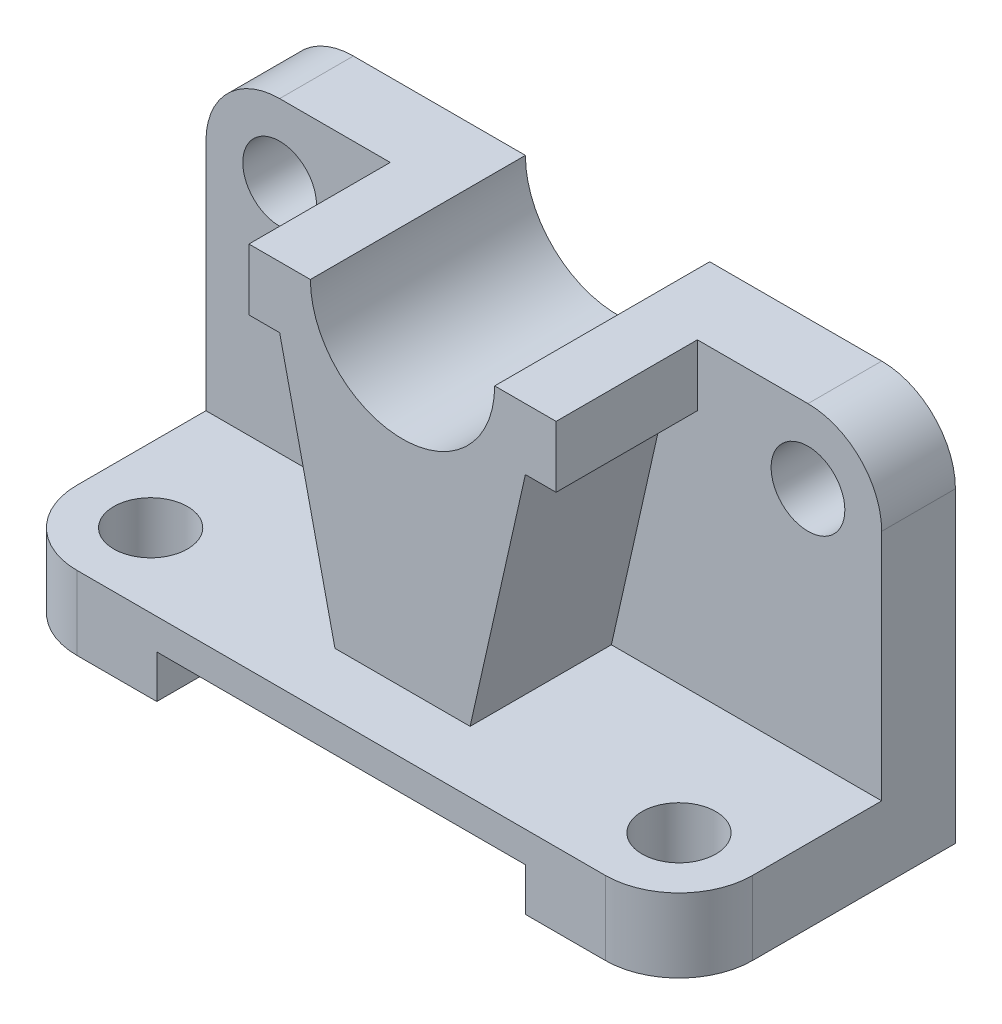
ISO-10303-21;
HEADER;
FILE_DESCRIPTION(('STEP AP214'),'2;1');
FILE_NAME('part.step','',(''),(''),'','','');
FILE_SCHEMA(('AUTOMOTIVE_DESIGN { 1 0 10303 214 1 1 1 1 }'));
ENDSEC;
DATA;
#1=APPLICATION_CONTEXT('core data for automotive mechanical design processes');
#2=APPLICATION_PROTOCOL_DEFINITION('international standard','automotive_design',2000,#1);
#3=PRODUCT_CONTEXT('',#1,'mechanical');
#4=PRODUCT('Part','Part','',(#3));
#5=PRODUCT_RELATED_PRODUCT_CATEGORY('part','',(#4));
#6=PRODUCT_DEFINITION_FORMATION('','',#4);
#7=PRODUCT_DEFINITION_CONTEXT('part definition',#1,'design');
#8=PRODUCT_DEFINITION('design','',#6,#7);
#9=PRODUCT_DEFINITION_SHAPE('','',#8);
#10=(LENGTH_UNIT() NAMED_UNIT(*) SI_UNIT(.MILLI.,.METRE.));
#11=(NAMED_UNIT(*) PLANE_ANGLE_UNIT() SI_UNIT($,.RADIAN.));
#12=(NAMED_UNIT(*) SI_UNIT($,.STERADIAN.) SOLID_ANGLE_UNIT());
#13=UNCERTAINTY_MEASURE_WITH_UNIT(LENGTH_MEASURE(1.E-05),#10,'distance_accuracy_value','');
#14=(GEOMETRIC_REPRESENTATION_CONTEXT(3) GLOBAL_UNCERTAINTY_ASSIGNED_CONTEXT((#13)) GLOBAL_UNIT_ASSIGNED_CONTEXT((#10,
#11,#12)) REPRESENTATION_CONTEXT('',''));
#15=CARTESIAN_POINT('',(0.,0.,0.));
#16=DIRECTION('',(0.,0.,1.));
#17=DIRECTION('',(1.,0.,0.));
#18=AXIS2_PLACEMENT_3D('',#15,#16,#17);
#19=CARTESIAN_POINT('',(110.,39.1654570634222,-10.4242661385534));
#20=DIRECTION('',(0.,-1.,0.));
#21=DIRECTION('',(0.,0.,-1.));
#22=AXIS2_PLACEMENT_3D('',#19,#20,#21);
#23=PLANE('',#22);
#24=DIRECTION('',(-1.,0.,0.));
#25=VECTOR('',#24,1.);
#26=CARTESIAN_POINT('',(110.,39.1654570634222,-22.4242661385534));
#27=LINE('',#26,#25);
#28=CARTESIAN_POINT('',(98.,39.1654570634222,-22.4242661385534));
#29=VERTEX_POINT('',#28);
#30=CARTESIAN_POINT('',(70.,39.1654570634222,-22.4242661385534));
#31=VERTEX_POINT('',#30);
#32=EDGE_CURVE('E221',#29,#31,#27,.T.);
#33=ORIENTED_EDGE('',*,*,#32,.T.);
#34=DIRECTION('',(0.,0.,1.));
#35=VECTOR('',#34,1.);
#36=CARTESIAN_POINT('',(70.,39.1654570634222,-22.4242661385534));
#37=LINE('',#36,#35);
#38=CARTESIAN_POINT('',(70.,39.1654570634222,12.5757338614466));
#39=VERTEX_POINT('',#38);
#40=EDGE_CURVE('E204',#31,#39,#37,.T.);
#41=ORIENTED_EDGE('',*,*,#40,.T.);
#42=DIRECTION('',(-1.,0.,0.));
#43=VECTOR('',#42,1.);
#44=CARTESIAN_POINT('',(70.,39.1654570634222,12.5757338614466));
#45=LINE('',#44,#43);
#46=CARTESIAN_POINT('',(80.,39.1654570634222,12.5757338614466));
#47=VERTEX_POINT('',#46);
#48=EDGE_CURVE('E215',#47,#39,#45,.T.);
#49=ORIENTED_EDGE('',*,*,#48,.F.);
#50=DIRECTION('',(0.,0.,1.));
#51=VECTOR('',#50,1.);
#52=CARTESIAN_POINT('',(80.,39.1654570634222,-22.4242661385534));
#53=LINE('',#52,#51);
#54=CARTESIAN_POINT('',(80.,39.1654570634222,-10.4242661385534));
#55=VERTEX_POINT('',#54);
#56=EDGE_CURVE('E310',#55,#47,#53,.T.);
#57=ORIENTED_EDGE('',*,*,#56,.F.);
#58=DIRECTION('',(-1.,0.,0.));
#59=VECTOR('',#58,1.);
#60=CARTESIAN_POINT('',(110.,39.1654570634222,-10.4242661385534));
#61=LINE('',#60,#59);
#62=CARTESIAN_POINT('',(98.,39.1654570634222,-10.4242661385534));
#63=VERTEX_POINT('',#62);
#64=EDGE_CURVE('E231',#63,#55,#61,.T.);
#65=ORIENTED_EDGE('',*,*,#64,.F.);
#66=DIRECTION('',(0.,0.,1.));
#67=VECTOR('',#66,1.);
#68=CARTESIAN_POINT('',(98.,39.1654570634222,-10.4242661385534));
#69=LINE('',#68,#67);
#70=EDGE_CURVE('E228',#63,#29,#69,.F.);
#71=ORIENTED_EDGE('',*,*,#70,.T.);
#72=EDGE_LOOP('',(#33,#41,#49,#57,#65,#71));
#73=FACE_BOUND('',#72,.T.);
#74=ADVANCED_FACE('F39',(#73),#23,.F.);
#75=CARTESIAN_POINT('',(110.,-22.8345429365778,-22.4242661385534));
#76=DIRECTION('',(0.,1.,0.));
#77=DIRECTION('',(0.,0.,1.));
#78=AXIS2_PLACEMENT_3D('',#75,#76,#77);
#79=PLANE('',#78);
#80=CARTESIAN_POINT('',(12.,-22.8345429365778,10.5757338614466));
#81=DIRECTION('',(0.,1.,0.));
#82=DIRECTION('',(0.,0.,1.));
#83=AXIS2_PLACEMENT_3D('',#80,#81,#82);
#84=CIRCLE('',#83,6.);
#85=CARTESIAN_POINT('',(12.,-22.8345429365778,16.5757338614466));
#86=VERTEX_POINT('',#85);
#87=EDGE_CURVE('E453',#86,#86,#84,.T.);
#88=ORIENTED_EDGE('',*,*,#87,.T.);
#89=EDGE_LOOP('',(#88));
#90=FACE_BOUND('',#89,.T.);
#91=DIRECTION('',(-1.,0.,0.));
#92=VECTOR('',#91,1.);
#93=CARTESIAN_POINT('',(110.,-22.8345429365778,-22.4242661385534));
#94=LINE('',#93,#92);
#95=CARTESIAN_POINT('',(25.,-22.8345429365778,-22.4242661385534));
#96=VERTEX_POINT('',#95);
#97=CARTESIAN_POINT('',(0.,-22.8345429365778,-22.4242661385534));
#98=VERTEX_POINT('',#97);
#99=EDGE_CURVE('E431',#96,#98,#94,.T.);
#100=ORIENTED_EDGE('',*,*,#99,.F.);
#101=DIRECTION('',(0.,0.,1.));
#102=VECTOR('',#101,1.);
#103=CARTESIAN_POINT('',(25.,-22.8345429365778,-22.4242661385534));
#104=LINE('',#103,#102);
#105=CARTESIAN_POINT('',(25.,-22.8345429365778,22.5757338614466));
#106=VERTEX_POINT('',#105);
#107=EDGE_CURVE('E273',#96,#106,#104,.T.);
#108=ORIENTED_EDGE('',*,*,#107,.T.);
#109=DIRECTION('',(-1.,0.,0.));
#110=VECTOR('',#109,1.);
#111=CARTESIAN_POINT('',(110.,-22.8345429365778,22.5757338614466));
#112=LINE('',#111,#110);
#113=CARTESIAN_POINT('',(12.,-22.8345429365778,22.5757338614466));
#114=VERTEX_POINT('',#113);
#115=EDGE_CURVE('E427',#106,#114,#112,.T.);
#116=ORIENTED_EDGE('',*,*,#115,.T.);
#117=CARTESIAN_POINT('',(12.,-22.8345429365778,10.5757338614466));
#118=DIRECTION('',(0.,1.,0.));
#119=DIRECTION('',(0.,0.,1.));
#120=AXIS2_PLACEMENT_3D('',#117,#118,#119);
#121=CIRCLE('',#120,12.);
#122=CARTESIAN_POINT('',(0.,-22.8345429365778,10.5757338614465));
#123=VERTEX_POINT('',#122);
#124=EDGE_CURVE('E259',#114,#123,#121,.F.);
#125=ORIENTED_EDGE('',*,*,#124,.T.);
#126=DIRECTION('',(0.,0.,-1.));
#127=VECTOR('',#126,1.);
#128=CARTESIAN_POINT('',(0.,-22.8345429365778,-22.4242661385534));
#129=LINE('',#128,#127);
#130=EDGE_CURVE('E432',#123,#98,#129,.T.);
#131=ORIENTED_EDGE('',*,*,#130,.T.);
#132=EDGE_LOOP('',(#100,#108,#116,#125,#131));
#133=FACE_BOUND('',#132,.T.);
#134=ADVANCED_FACE('F505',(#90,#133),#79,.F.);
#135=CARTESIAN_POINT('',(110.,39.1654570634222,-22.4242661385534));
#136=DIRECTION('',(0.,0.,1.));
#137=DIRECTION('',(0.,-1.,0.));
#138=AXIS2_PLACEMENT_3D('',#135,#136,#137);
#139=PLANE('',#138);
#140=CARTESIAN_POINT('',(40.,39.1654570634222,-22.4242661385534));
#141=VERTEX_POINT('',#140);
#142=CARTESIAN_POINT('',(12.,39.1654570634222,-22.4242661385534));
#143=VERTEX_POINT('',#142);
#144=EDGE_CURVE('E43',#141,#143,#27,.T.);
#145=ORIENTED_EDGE('',*,*,#144,.F.);
#146=CARTESIAN_POINT('',(55.,39.1654570634222,-22.4242661385534));
#147=DIRECTION('',(0.,0.,1.));
#148=DIRECTION('',(0.,-1.,0.));
#149=AXIS2_PLACEMENT_3D('',#146,#147,#148);
#150=CIRCLE('',#149,15.);
#151=EDGE_CURVE('E207',#141,#31,#150,.T.);
#152=ORIENTED_EDGE('',*,*,#151,.T.);
#153=ORIENTED_EDGE('',*,*,#32,.F.);
#154=CARTESIAN_POINT('',(98.,27.1654570634222,-22.4242661385534));
#155=DIRECTION('',(0.,0.,1.));
#156=DIRECTION('',(0.,-1.,0.));
#157=AXIS2_PLACEMENT_3D('',#154,#155,#156);
#158=CIRCLE('',#157,12.);
#159=CARTESIAN_POINT('',(110.,27.1654570634222,-22.4242661385534));
#160=VERTEX_POINT('',#159);
#161=EDGE_CURVE('E248',#29,#160,#158,.F.);
#162=ORIENTED_EDGE('',*,*,#161,.T.);
#163=DIRECTION('',(0.,1.,0.));
#164=VECTOR('',#163,1.);
#165=CARTESIAN_POINT('',(110.,39.1654570634222,-22.4242661385534));
#166=LINE('',#165,#164);
#167=CARTESIAN_POINT('',(110.,-22.8345429365778,-22.4242661385534));
#168=VERTEX_POINT('',#167);
#169=EDGE_CURVE('E435',#168,#160,#166,.T.);
#170=ORIENTED_EDGE('',*,*,#169,.F.);
#171=CARTESIAN_POINT('',(85.,-22.8345429365778,-22.4242661385534));
#172=VERTEX_POINT('',#171);
#173=EDGE_CURVE('E428',#168,#172,#94,.T.);
#174=ORIENTED_EDGE('',*,*,#173,.T.);
#175=DIRECTION('',(0.,1.,0.));
#176=VECTOR('',#175,1.);
#177=CARTESIAN_POINT('',(85.,39.1654570634222,-22.4242661385534));
#178=LINE('',#177,#176);
#179=CARTESIAN_POINT('',(85.,-15.8345429365778,-22.4242661385534));
#180=VERTEX_POINT('',#179);
#181=EDGE_CURVE('E65',#172,#180,#178,.T.);
#182=ORIENTED_EDGE('',*,*,#181,.T.);
#183=DIRECTION('',(-1.,0.,0.));
#184=VECTOR('',#183,1.);
#185=CARTESIAN_POINT('',(110.,-15.8345429365778,-22.4242661385534));
#186=LINE('',#185,#184);
#187=CARTESIAN_POINT('',(25.,-15.8345429365778,-22.4242661385534));
#188=VERTEX_POINT('',#187);
#189=EDGE_CURVE('E469',#180,#188,#186,.T.);
#190=ORIENTED_EDGE('',*,*,#189,.T.);
#191=DIRECTION('',(0.,-1.,0.));
#192=VECTOR('',#191,1.);
#193=CARTESIAN_POINT('',(25.,39.1654570634222,-22.4242661385534));
#194=LINE('',#193,#192);
#195=EDGE_CURVE('E479',#188,#96,#194,.T.);
#196=ORIENTED_EDGE('',*,*,#195,.T.);
#197=ORIENTED_EDGE('',*,*,#99,.T.);
#198=DIRECTION('',(0.,1.,0.));
#199=VECTOR('',#198,1.);
#200=CARTESIAN_POINT('',(0.,39.1654570634222,-22.4242661385534));
#201=LINE('',#200,#199);
#202=CARTESIAN_POINT('',(0.,27.1654570634222,-22.4242661385534));
#203=VERTEX_POINT('',#202);
#204=EDGE_CURVE('E440',#98,#203,#201,.T.);
#205=ORIENTED_EDGE('',*,*,#204,.T.);
#206=CARTESIAN_POINT('',(12.,27.1654570634222,-22.4242661385534));
#207=DIRECTION('',(0.,0.,1.));
#208=DIRECTION('',(0.,-1.,0.));
#209=AXIS2_PLACEMENT_3D('',#206,#207,#208);
#210=CIRCLE('',#209,12.);
#211=EDGE_CURVE('E250',#203,#143,#210,.F.);
#212=ORIENTED_EDGE('',*,*,#211,.T.);
#213=EDGE_LOOP('',(#145,#152,#153,#162,#170,#174,#182,#190,#196,#197,#205,#212));
#214=FACE_BOUND('',#213,.T.);
#215=CARTESIAN_POINT('',(12.,27.1654570634222,-22.4242661385534));
#216=DIRECTION('',(0.,0.,1.));
#217=DIRECTION('',(1.,0.,0.));
#218=AXIS2_PLACEMENT_3D('',#215,#216,#217);
#219=CIRCLE('',#218,6.);
#220=CARTESIAN_POINT('',(18.,27.1654570634222,-22.4242661385534));
#221=VERTEX_POINT('',#220);
#222=EDGE_CURVE('E457',#221,#221,#219,.T.);
#223=ORIENTED_EDGE('',*,*,#222,.T.);
#224=EDGE_LOOP('',(#223));
#225=FACE_BOUND('',#224,.T.);
#226=CARTESIAN_POINT('',(98.,27.1654570634222,-22.4242661385534));
#227=DIRECTION('',(0.,0.,1.));
#228=DIRECTION('',(1.,0.,0.));
#229=AXIS2_PLACEMENT_3D('',#226,#227,#228);
#230=CIRCLE('',#229,6.);
#231=CARTESIAN_POINT('',(104.,27.1654570634222,-22.4242661385534));
#232=VERTEX_POINT('',#231);
#233=EDGE_CURVE('E465',#232,#232,#230,.T.);
#234=ORIENTED_EDGE('',*,*,#233,.T.);
#235=EDGE_LOOP('',(#234));
#236=FACE_BOUND('',#235,.T.);
#237=ADVANCED_FACE('F219',(#214,#225,#236),#139,.F.);
#238=DIRECTION('',(0.,0.,1.));
#239=VECTOR('',#238,1.);
#240=CARTESIAN_POINT('',(40.,39.1654570634222,-22.4242661385534));
#241=LINE('',#240,#239);
#242=CARTESIAN_POINT('',(40.,39.1654570634222,12.5757338614466));
#243=VERTEX_POINT('',#242);
#244=EDGE_CURVE('E332',#141,#243,#241,.T.);
#245=ORIENTED_EDGE('',*,*,#244,.F.);
#246=ORIENTED_EDGE('',*,*,#144,.T.);
#247=DIRECTION('',(0.,0.,1.));
#248=VECTOR('',#247,1.);
#249=CARTESIAN_POINT('',(12.,39.1654570634222,-10.4242661385534));
#250=LINE('',#249,#248);
#251=CARTESIAN_POINT('',(12.,39.1654570634222,-10.4242661385534));
#252=VERTEX_POINT('',#251);
#253=EDGE_CURVE('E229',#143,#252,#250,.T.);
#254=ORIENTED_EDGE('',*,*,#253,.T.);
#255=CARTESIAN_POINT('',(30.,39.1654570634222,-10.4242661385534));
#256=VERTEX_POINT('',#255);
#257=EDGE_CURVE('E410',#256,#252,#61,.T.);
#258=ORIENTED_EDGE('',*,*,#257,.F.);
#259=DIRECTION('',(0.,0.,1.));
#260=VECTOR('',#259,1.);
#261=CARTESIAN_POINT('',(30.,39.1654570634222,-22.4242661385534));
#262=LINE('',#261,#260);
#263=CARTESIAN_POINT('',(30.,39.1654570634222,12.5757338614466));
#264=VERTEX_POINT('',#263);
#265=EDGE_CURVE('E57',#256,#264,#262,.T.);
#266=ORIENTED_EDGE('',*,*,#265,.T.);
#267=DIRECTION('',(-1.,0.,0.));
#268=VECTOR('',#267,1.);
#269=CARTESIAN_POINT('',(30.,39.1654570634222,12.5757338614466));
#270=LINE('',#269,#268);
#271=EDGE_CURVE('E224',#243,#264,#270,.T.);
#272=ORIENTED_EDGE('',*,*,#271,.F.);
#273=EDGE_LOOP('',(#245,#246,#254,#258,#266,#272));
#274=FACE_BOUND('',#273,.T.);
#275=ADVANCED_FACE('F409',(#274),#23,.F.);
#276=CARTESIAN_POINT('',(110.,39.1654570634222,-10.4242661385534));
#277=DIRECTION('',(0.,0.,-1.));
#278=DIRECTION('',(-1.,0.,0.));
#279=AXIS2_PLACEMENT_3D('',#276,#277,#278);
#280=PLANE('',#279);
#281=CARTESIAN_POINT('',(12.,27.1654570634222,-10.4242661385534));
#282=DIRECTION('',(0.,0.,1.));
#283=DIRECTION('',(1.,0.,0.));
#284=AXIS2_PLACEMENT_3D('',#281,#282,#283);
#285=CIRCLE('',#284,6.);
#286=CARTESIAN_POINT('',(18.,27.1654570634222,-10.4242661385534));
#287=VERTEX_POINT('',#286);
#288=EDGE_CURVE('E472',#287,#287,#285,.T.);
#289=ORIENTED_EDGE('',*,*,#288,.F.);
#290=EDGE_LOOP('',(#289));
#291=FACE_BOUND('',#290,.T.);
#292=CARTESIAN_POINT('',(98.,27.1654570634222,-10.4242661385534));
#293=DIRECTION('',(0.,0.,1.));
#294=DIRECTION('',(1.,0.,0.));
#295=AXIS2_PLACEMENT_3D('',#292,#293,#294);
#296=CIRCLE('',#295,6.);
#297=CARTESIAN_POINT('',(104.,27.1654570634222,-10.4242661385534));
#298=VERTEX_POINT('',#297);
#299=EDGE_CURVE('E468',#298,#298,#296,.T.);
#300=ORIENTED_EDGE('',*,*,#299,.F.);
#301=EDGE_LOOP('',(#300));
#302=FACE_BOUND('',#301,.T.);
#303=ORIENTED_EDGE('',*,*,#64,.T.);
#304=DIRECTION('',(0.,-1.,0.));
#305=VECTOR('',#304,1.);
#306=CARTESIAN_POINT('',(80.,39.1654570634222,-10.4242661385534));
#307=LINE('',#306,#305);
#308=CARTESIAN_POINT('',(80.,29.1654570634222,-10.4242661385534));
#309=VERTEX_POINT('',#308);
#310=EDGE_CURVE('E12',#55,#309,#307,.T.);
#311=ORIENTED_EDGE('',*,*,#310,.T.);
#312=DIRECTION('',(-1.,0.,0.));
#313=VECTOR('',#312,1.);
#314=CARTESIAN_POINT('',(110.,29.1654570634222,-10.4242661385534));
#315=LINE('',#314,#313);
#316=CARTESIAN_POINT('',(75.,29.1654570634222,-10.4242661385534));
#317=VERTEX_POINT('',#316);
#318=EDGE_CURVE('E49',#309,#317,#315,.T.);
#319=ORIENTED_EDGE('',*,*,#318,.T.);
#320=DIRECTION('',(-0.219521860759889,-0.975607581278721,0.));
#321=VECTOR('',#320,1.);
#322=CARTESIAN_POINT('',(78.8283165734395,46.1794102963889,-10.4242661385534));
#323=LINE('',#322,#321);
#324=CARTESIAN_POINT('',(66.,-10.8326925564577,-10.4242661385534));
#325=VERTEX_POINT('',#324);
#326=EDGE_CURVE('E287',#317,#325,#323,.T.);
#327=ORIENTED_EDGE('',*,*,#326,.T.);
#328=DIRECTION('',(-1.,0.,0.));
#329=VECTOR('',#328,1.);
#330=CARTESIAN_POINT('',(110.,-10.8326925564577,-10.4242661385534));
#331=LINE('',#330,#329);
#332=CARTESIAN_POINT('',(44.,-10.8326925564577,-10.4242661385534));
#333=VERTEX_POINT('',#332);
#334=EDGE_CURVE('E284',#325,#333,#331,.T.);
#335=ORIENTED_EDGE('',*,*,#334,.T.);
#336=DIRECTION('',(-0.219521860759889,0.975607581278721,0.));
#337=VECTOR('',#336,1.);
#338=CARTESIAN_POINT('',(36.4725666352237,22.6210192188754,-10.4242661385534));
#339=LINE('',#338,#337);
#340=CARTESIAN_POINT('',(35.,29.1654570634222,-10.4242661385534));
#341=VERTEX_POINT('',#340);
#342=EDGE_CURVE('E281',#333,#341,#339,.T.);
#343=ORIENTED_EDGE('',*,*,#342,.T.);
#344=DIRECTION('',(-1.,0.,0.));
#345=VECTOR('',#344,1.);
#346=CARTESIAN_POINT('',(110.,29.1654570634222,-10.4242661385534));
#347=LINE('',#346,#345);
#348=CARTESIAN_POINT('',(30.,29.1654570634222,-10.4242661385534));
#349=VERTEX_POINT('',#348);
#350=EDGE_CURVE('E278',#341,#349,#347,.T.);
#351=ORIENTED_EDGE('',*,*,#350,.T.);
#352=DIRECTION('',(0.,1.,0.));
#353=VECTOR('',#352,1.);
#354=CARTESIAN_POINT('',(30.,39.1654570634222,-10.4242661385534));
#355=LINE('',#354,#353);
#356=EDGE_CURVE('E276',#349,#256,#355,.T.);
#357=ORIENTED_EDGE('',*,*,#356,.T.);
#358=ORIENTED_EDGE('',*,*,#257,.T.);
#359=CARTESIAN_POINT('',(12.,27.1654570634222,-10.4242661385534));
#360=DIRECTION('',(0.,0.,-1.));
#361=DIRECTION('',(-1.,0.,0.));
#362=AXIS2_PLACEMENT_3D('',#359,#360,#361);
#363=CIRCLE('',#362,12.);
#364=CARTESIAN_POINT('',(0.,27.1654570634222,-10.4242661385534));
#365=VERTEX_POINT('',#364);
#366=EDGE_CURVE('E242',#252,#365,#363,.F.);
#367=ORIENTED_EDGE('',*,*,#366,.T.);
#368=DIRECTION('',(0.,-1.,0.));
#369=VECTOR('',#368,1.);
#370=CARTESIAN_POINT('',(0.,39.1654570634222,-10.4242661385534));
#371=LINE('',#370,#369);
#372=CARTESIAN_POINT('',(0.,-10.8345429365778,-10.4242661385534));
#373=VERTEX_POINT('',#372);
#374=EDGE_CURVE('E438',#365,#373,#371,.T.);
#375=ORIENTED_EDGE('',*,*,#374,.T.);
#376=DIRECTION('',(-1.,0.,0.));
#377=VECTOR('',#376,1.);
#378=CARTESIAN_POINT('',(110.,-10.8345429365778,-10.4242661385534));
#379=LINE('',#378,#377);
#380=CARTESIAN_POINT('',(110.,-10.8345429365778,-10.4242661385534));
#381=VERTEX_POINT('',#380);
#382=EDGE_CURVE('E413',#381,#373,#379,.T.);
#383=ORIENTED_EDGE('',*,*,#382,.F.);
#384=DIRECTION('',(0.,-1.,0.));
#385=VECTOR('',#384,1.);
#386=CARTESIAN_POINT('',(110.,39.1654570634222,-10.4242661385534));
#387=LINE('',#386,#385);
#388=CARTESIAN_POINT('',(110.,27.1654570634222,-10.4242661385534));
#389=VERTEX_POINT('',#388);
#390=EDGE_CURVE('E449',#389,#381,#387,.T.);
#391=ORIENTED_EDGE('',*,*,#390,.F.);
#392=CARTESIAN_POINT('',(98.,27.1654570634222,-10.4242661385534));
#393=DIRECTION('',(0.,0.,-1.));
#394=DIRECTION('',(-1.,0.,0.));
#395=AXIS2_PLACEMENT_3D('',#392,#393,#394);
#396=CIRCLE('',#395,12.);
#397=EDGE_CURVE('E240',#389,#63,#396,.F.);
#398=ORIENTED_EDGE('',*,*,#397,.T.);
#399=EDGE_LOOP('',(#303,#311,#319,#327,#335,#343,#351,#357,#358,#367,#375,#383,#391,#398));
#400=FACE_BOUND('',#399,.T.);
#401=ADVANCED_FACE('F292',(#291,#302,#400),#280,.F.);
#402=CARTESIAN_POINT('',(110.,-10.8345429365778,22.5757338614466));
#403=DIRECTION('',(0.,-1.,0.));
#404=DIRECTION('',(0.,0.,-1.));
#405=AXIS2_PLACEMENT_3D('',#402,#403,#404);
#406=PLANE('',#405);
#407=CARTESIAN_POINT('',(98.,-10.8345429365778,10.5757338614466));
#408=DIRECTION('',(0.,1.,0.));
#409=DIRECTION('',(0.,0.,1.));
#410=AXIS2_PLACEMENT_3D('',#407,#408,#409);
#411=CIRCLE('',#410,6.);
#412=CARTESIAN_POINT('',(98.,-10.8345429365778,16.5757338614466));
#413=VERTEX_POINT('',#412);
#414=EDGE_CURVE('E460',#413,#413,#411,.T.);
#415=ORIENTED_EDGE('',*,*,#414,.F.);
#416=EDGE_LOOP('',(#415));
#417=FACE_BOUND('',#416,.T.);
#418=CARTESIAN_POINT('',(12.,-10.8345429365778,10.5757338614466));
#419=DIRECTION('',(0.,1.,0.));
#420=DIRECTION('',(0.,0.,1.));
#421=AXIS2_PLACEMENT_3D('',#418,#419,#420);
#422=CIRCLE('',#421,6.);
#423=CARTESIAN_POINT('',(12.,-10.8345429365778,16.5757338614466));
#424=VERTEX_POINT('',#423);
#425=EDGE_CURVE('E456',#424,#424,#422,.T.);
#426=ORIENTED_EDGE('',*,*,#425,.F.);
#427=EDGE_LOOP('',(#426));
#428=FACE_BOUND('',#427,.T.);
#429=DIRECTION('',(0.,0.,1.));
#430=VECTOR('',#429,1.);
#431=CARTESIAN_POINT('',(0.,-10.8345429365778,22.5757338614466));
#432=LINE('',#431,#430);
#433=CARTESIAN_POINT('',(0.,-10.8345429365778,10.5757338614466));
#434=VERTEX_POINT('',#433);
#435=EDGE_CURVE('E436',#373,#434,#432,.T.);
#436=ORIENTED_EDGE('',*,*,#435,.T.);
#437=CARTESIAN_POINT('',(12.,-10.8345429365778,10.5757338614466));
#438=DIRECTION('',(0.,-1.,0.));
#439=DIRECTION('',(0.,0.,-1.));
#440=AXIS2_PLACEMENT_3D('',#437,#438,#439);
#441=CIRCLE('',#440,12.);
#442=CARTESIAN_POINT('',(12.,-10.8345429365778,22.5757338614466));
#443=VERTEX_POINT('',#442);
#444=EDGE_CURVE('E263',#434,#443,#441,.F.);
#445=ORIENTED_EDGE('',*,*,#444,.T.);
#446=DIRECTION('',(-1.,0.,0.));
#447=VECTOR('',#446,1.);
#448=CARTESIAN_POINT('',(110.,-10.8345429365778,22.5757338614466));
#449=LINE('',#448,#447);
#450=CARTESIAN_POINT('',(98.,-10.8345429365778,22.5757338614466));
#451=VERTEX_POINT('',#450);
#452=EDGE_CURVE('E415',#451,#443,#449,.T.);
#453=ORIENTED_EDGE('',*,*,#452,.F.);
#454=CARTESIAN_POINT('',(98.,-10.8345429365778,10.5757338614466));
#455=DIRECTION('',(0.,-1.,0.));
#456=DIRECTION('',(0.,0.,-1.));
#457=AXIS2_PLACEMENT_3D('',#454,#455,#456);
#458=CIRCLE('',#457,12.);
#459=CARTESIAN_POINT('',(110.,-10.8345429365778,10.5757338614466));
#460=VERTEX_POINT('',#459);
#461=EDGE_CURVE('E261',#451,#460,#458,.F.);
#462=ORIENTED_EDGE('',*,*,#461,.T.);
#463=DIRECTION('',(0.,0.,1.));
#464=VECTOR('',#463,1.);
#465=CARTESIAN_POINT('',(110.,-10.8345429365778,22.5757338614466));
#466=LINE('',#465,#464);
#467=EDGE_CURVE('E446',#381,#460,#466,.T.);
#468=ORIENTED_EDGE('',*,*,#467,.F.);
#469=ORIENTED_EDGE('',*,*,#382,.T.);
#470=EDGE_LOOP('',(#436,#445,#453,#462,#468,#469));
#471=FACE_BOUND('',#470,.T.);
#472=ADVANCED_FACE('F538',(#417,#428,#471),#406,.F.);
#473=CARTESIAN_POINT('',(110.,-22.8345429365778,22.5757338614466));
#474=DIRECTION('',(0.,0.,-1.));
#475=DIRECTION('',(-1.,0.,0.));
#476=AXIS2_PLACEMENT_3D('',#473,#474,#475);
#477=PLANE('',#476);
#478=ORIENTED_EDGE('',*,*,#115,.F.);
#479=DIRECTION('',(0.,-1.,0.));
#480=VECTOR('',#479,1.);
#481=CARTESIAN_POINT('',(25.,-22.8345429365778,22.5757338614466));
#482=LINE('',#481,#480);
#483=CARTESIAN_POINT('',(25.,-15.8345429365778,22.5757338614466));
#484=VERTEX_POINT('',#483);
#485=EDGE_CURVE('E486',#484,#106,#482,.T.);
#486=ORIENTED_EDGE('',*,*,#485,.F.);
#487=DIRECTION('',(-1.,0.,0.));
#488=VECTOR('',#487,1.);
#489=CARTESIAN_POINT('',(25.,-15.8345429365778,22.5757338614466));
#490=LINE('',#489,#488);
#491=CARTESIAN_POINT('',(85.,-15.8345429365778,22.5757338614466));
#492=VERTEX_POINT('',#491);
#493=EDGE_CURVE('E488',#492,#484,#490,.T.);
#494=ORIENTED_EDGE('',*,*,#493,.F.);
#495=DIRECTION('',(0.,1.,0.));
#496=VECTOR('',#495,1.);
#497=CARTESIAN_POINT('',(85.,-15.8345429365778,22.5757338614466));
#498=LINE('',#497,#496);
#499=CARTESIAN_POINT('',(85.,-22.8345429365778,22.5757338614466));
#500=VERTEX_POINT('',#499);
#501=EDGE_CURVE('E335',#500,#492,#498,.T.);
#502=ORIENTED_EDGE('',*,*,#501,.F.);
#503=CARTESIAN_POINT('',(98.,-22.8345429365778,22.5757338614466));
#504=VERTEX_POINT('',#503);
#505=EDGE_CURVE('E422',#504,#500,#112,.T.);
#506=ORIENTED_EDGE('',*,*,#505,.F.);
#507=DIRECTION('',(0.,-1.,0.));
#508=VECTOR('',#507,1.);
#509=CARTESIAN_POINT('',(98.,-22.8345429365778,22.5757338614466));
#510=LINE('',#509,#508);
#511=EDGE_CURVE('E252',#504,#451,#510,.F.);
#512=ORIENTED_EDGE('',*,*,#511,.T.);
#513=ORIENTED_EDGE('',*,*,#452,.T.);
#514=DIRECTION('',(0.,-1.,0.));
#515=VECTOR('',#514,1.);
#516=CARTESIAN_POINT('',(12.,-22.8345429365778,22.5757338614466));
#517=LINE('',#516,#515);
#518=EDGE_CURVE('E254',#443,#114,#517,.T.);
#519=ORIENTED_EDGE('',*,*,#518,.T.);
#520=EDGE_LOOP('',(#478,#486,#494,#502,#506,#512,#513,#519));
#521=FACE_BOUND('',#520,.T.);
#522=ADVANCED_FACE('F500',(#521),#477,.F.);
#523=CARTESIAN_POINT('',(98.,-22.8345429365778,10.5757338614466));
#524=DIRECTION('',(0.,1.,0.));
#525=DIRECTION('',(0.,0.,1.));
#526=AXIS2_PLACEMENT_3D('',#523,#524,#525);
#527=CIRCLE('',#526,6.);
#528=CARTESIAN_POINT('',(98.,-22.8345429365778,16.5757338614466));
#529=VERTEX_POINT('',#528);
#530=EDGE_CURVE('E443',#529,#529,#527,.T.);
#531=ORIENTED_EDGE('',*,*,#530,.T.);
#532=EDGE_LOOP('',(#531));
#533=FACE_BOUND('',#532,.T.);
#534=ORIENTED_EDGE('',*,*,#505,.T.);
#535=DIRECTION('',(0.,0.,-1.));
#536=VECTOR('',#535,1.);
#537=CARTESIAN_POINT('',(85.,-22.8345429365778,-22.4242661385534));
#538=LINE('',#537,#536);
#539=EDGE_CURVE('E271',#500,#172,#538,.T.);
#540=ORIENTED_EDGE('',*,*,#539,.T.);
#541=ORIENTED_EDGE('',*,*,#173,.F.);
#542=DIRECTION('',(0.,0.,-1.));
#543=VECTOR('',#542,1.);
#544=CARTESIAN_POINT('',(110.,-22.8345429365778,-22.4242661385534));
#545=LINE('',#544,#543);
#546=CARTESIAN_POINT('',(110.,-22.8345429365778,10.5757338614465));
#547=VERTEX_POINT('',#546);
#548=EDGE_CURVE('E444',#547,#168,#545,.T.);
#549=ORIENTED_EDGE('',*,*,#548,.F.);
#550=CARTESIAN_POINT('',(98.,-22.8345429365778,10.5757338614466));
#551=DIRECTION('',(0.,1.,0.));
#552=DIRECTION('',(0.,0.,1.));
#553=AXIS2_PLACEMENT_3D('',#550,#551,#552);
#554=CIRCLE('',#553,12.);
#555=EDGE_CURVE('E257',#547,#504,#554,.F.);
#556=ORIENTED_EDGE('',*,*,#555,.T.);
#557=EDGE_LOOP('',(#534,#540,#541,#549,#556));
#558=FACE_BOUND('',#557,.T.);
#559=ADVANCED_FACE('F530',(#533,#558),#79,.F.);
#560=CARTESIAN_POINT('',(110.,0.,0.));
#561=DIRECTION('',(-1.,0.,0.));
#562=DIRECTION('',(0.,0.,1.));
#563=AXIS2_PLACEMENT_3D('',#560,#561,#562);
#564=PLANE('',#563);
#565=ORIENTED_EDGE('',*,*,#467,.T.);
#566=DIRECTION('',(0.,-1.,0.));
#567=VECTOR('',#566,1.);
#568=CARTESIAN_POINT('',(110.,0.,10.5757338614466));
#569=LINE('',#568,#567);
#570=EDGE_CURVE('E268',#460,#547,#569,.T.);
#571=ORIENTED_EDGE('',*,*,#570,.T.);
#572=ORIENTED_EDGE('',*,*,#548,.T.);
#573=ORIENTED_EDGE('',*,*,#169,.T.);
#574=DIRECTION('',(0.,0.,1.));
#575=VECTOR('',#574,1.);
#576=CARTESIAN_POINT('',(110.,27.1654570634222,0.));
#577=LINE('',#576,#575);
#578=EDGE_CURVE('E265',#160,#389,#577,.T.);
#579=ORIENTED_EDGE('',*,*,#578,.T.);
#580=ORIENTED_EDGE('',*,*,#390,.T.);
#581=EDGE_LOOP('',(#565,#571,#572,#573,#579,#580));
#582=FACE_BOUND('',#581,.T.);
#583=ADVANCED_FACE('F564',(#582),#564,.F.);
#584=CARTESIAN_POINT('',(0.,0.,0.));
#585=DIRECTION('',(-1.,0.,0.));
#586=DIRECTION('',(0.,0.,1.));
#587=AXIS2_PLACEMENT_3D('',#584,#585,#586);
#588=PLANE('',#587);
#589=ORIENTED_EDGE('',*,*,#374,.F.);
#590=DIRECTION('',(0.,0.,1.));
#591=VECTOR('',#590,1.);
#592=CARTESIAN_POINT('',(0.,27.1654570634222,-22.4242661385534));
#593=LINE('',#592,#591);
#594=EDGE_CURVE('E246',#365,#203,#593,.F.);
#595=ORIENTED_EDGE('',*,*,#594,.T.);
#596=ORIENTED_EDGE('',*,*,#204,.F.);
#597=ORIENTED_EDGE('',*,*,#130,.F.);
#598=DIRECTION('',(0.,-1.,0.));
#599=VECTOR('',#598,1.);
#600=CARTESIAN_POINT('',(0.,-10.8345429365778,10.5757338614466));
#601=LINE('',#600,#599);
#602=EDGE_CURVE('E244',#123,#434,#601,.F.);
#603=ORIENTED_EDGE('',*,*,#602,.T.);
#604=ORIENTED_EDGE('',*,*,#435,.F.);
#605=EDGE_LOOP('',(#589,#595,#596,#597,#603,#604));
#606=FACE_BOUND('',#605,.T.);
#607=ADVANCED_FACE('F547',(#606),#588,.T.);
#608=CARTESIAN_POINT('',(12.,27.1654570634222,-10.4242661385534));
#609=DIRECTION('',(0.,0.,-1.));
#610=DIRECTION('',(-1.,0.,0.));
#611=AXIS2_PLACEMENT_3D('',#608,#609,#610);
#612=CYLINDRICAL_SURFACE('',#611,12.);
#613=ORIENTED_EDGE('',*,*,#211,.F.);
#614=ORIENTED_EDGE('',*,*,#594,.F.);
#615=ORIENTED_EDGE('',*,*,#366,.F.);
#616=ORIENTED_EDGE('',*,*,#253,.F.);
#617=EDGE_LOOP('',(#613,#614,#615,#616));
#618=FACE_BOUND('',#617,.T.);
#619=ADVANCED_FACE('F543',(#618),#612,.T.);
#620=CARTESIAN_POINT('',(12.,-22.8345429365778,10.5757338614466));
#621=DIRECTION('',(0.,1.,0.));
#622=DIRECTION('',(0.,0.,1.));
#623=AXIS2_PLACEMENT_3D('',#620,#621,#622);
#624=CYLINDRICAL_SURFACE('',#623,12.);
#625=ORIENTED_EDGE('',*,*,#444,.F.);
#626=ORIENTED_EDGE('',*,*,#602,.F.);
#627=ORIENTED_EDGE('',*,*,#124,.F.);
#628=ORIENTED_EDGE('',*,*,#518,.F.);
#629=EDGE_LOOP('',(#625,#626,#627,#628));
#630=FACE_BOUND('',#629,.T.);
#631=ADVANCED_FACE('F546',(#630),#624,.T.);
#632=CARTESIAN_POINT('',(98.,0.,10.5757338614466));
#633=DIRECTION('',(0.,-1.,0.));
#634=DIRECTION('',(0.,0.,-1.));
#635=AXIS2_PLACEMENT_3D('',#632,#633,#634);
#636=CYLINDRICAL_SURFACE('',#635,12.);
#637=ORIENTED_EDGE('',*,*,#461,.F.);
#638=ORIENTED_EDGE('',*,*,#511,.F.);
#639=ORIENTED_EDGE('',*,*,#555,.F.);
#640=ORIENTED_EDGE('',*,*,#570,.F.);
#641=EDGE_LOOP('',(#637,#638,#639,#640));
#642=FACE_BOUND('',#641,.T.);
#643=ADVANCED_FACE('F550',(#642),#636,.T.);
#644=CARTESIAN_POINT('',(98.,27.1654570634222,0.));
#645=DIRECTION('',(0.,0.,1.));
#646=DIRECTION('',(1.,0.,0.));
#647=AXIS2_PLACEMENT_3D('',#644,#645,#646);
#648=CYLINDRICAL_SURFACE('',#647,12.);
#649=ORIENTED_EDGE('',*,*,#161,.F.);
#650=ORIENTED_EDGE('',*,*,#70,.F.);
#651=ORIENTED_EDGE('',*,*,#397,.F.);
#652=ORIENTED_EDGE('',*,*,#578,.F.);
#653=EDGE_LOOP('',(#649,#650,#651,#652));
#654=FACE_BOUND('',#653,.T.);
#655=ADVANCED_FACE('F41',(#654),#648,.T.);
#656=CARTESIAN_POINT('',(12.,-22.8345429365778,10.5757338614466));
#657=DIRECTION('',(0.,1.,0.));
#658=DIRECTION('',(0.,0.,1.));
#659=AXIS2_PLACEMENT_3D('',#656,#657,#658);
#660=CYLINDRICAL_SURFACE('',#659,6.);
#661=ORIENTED_EDGE('',*,*,#87,.F.);
#662=EDGE_LOOP('',(#661));
#663=FACE_BOUND('',#662,.T.);
#664=ORIENTED_EDGE('',*,*,#425,.T.);
#665=EDGE_LOOP('',(#664));
#666=FACE_BOUND('',#665,.T.);
#667=ADVANCED_FACE('F557',(#663,#666),#660,.F.);
#668=CARTESIAN_POINT('',(98.,-22.8345429365778,10.5757338614466));
#669=DIRECTION('',(0.,1.,0.));
#670=DIRECTION('',(0.,0.,1.));
#671=AXIS2_PLACEMENT_3D('',#668,#669,#670);
#672=CYLINDRICAL_SURFACE('',#671,6.);
#673=ORIENTED_EDGE('',*,*,#530,.F.);
#674=EDGE_LOOP('',(#673));
#675=FACE_BOUND('',#674,.T.);
#676=ORIENTED_EDGE('',*,*,#414,.T.);
#677=EDGE_LOOP('',(#676));
#678=FACE_BOUND('',#677,.T.);
#679=ADVANCED_FACE('F596',(#675,#678),#672,.F.);
#680=CARTESIAN_POINT('',(98.,27.1654570634222,-22.4242661385534));
#681=DIRECTION('',(0.,0.,1.));
#682=DIRECTION('',(1.,0.,0.));
#683=AXIS2_PLACEMENT_3D('',#680,#681,#682);
#684=CYLINDRICAL_SURFACE('',#683,6.);
#685=ORIENTED_EDGE('',*,*,#233,.F.);
#686=EDGE_LOOP('',(#685));
#687=FACE_BOUND('',#686,.T.);
#688=ORIENTED_EDGE('',*,*,#299,.T.);
#689=EDGE_LOOP('',(#688));
#690=FACE_BOUND('',#689,.T.);
#691=ADVANCED_FACE('F519',(#687,#690),#684,.F.);
#692=CARTESIAN_POINT('',(12.,27.1654570634222,-22.4242661385534));
#693=DIRECTION('',(0.,0.,1.));
#694=DIRECTION('',(1.,0.,0.));
#695=AXIS2_PLACEMENT_3D('',#692,#693,#694);
#696=CYLINDRICAL_SURFACE('',#695,6.);
#697=ORIENTED_EDGE('',*,*,#222,.F.);
#698=EDGE_LOOP('',(#697));
#699=FACE_BOUND('',#698,.T.);
#700=ORIENTED_EDGE('',*,*,#288,.T.);
#701=EDGE_LOOP('',(#700));
#702=FACE_BOUND('',#701,.T.);
#703=ADVANCED_FACE('F512',(#699,#702),#696,.F.);
#704=CARTESIAN_POINT('',(25.,-15.8345429365778,-37.4242661385534));
#705=DIRECTION('',(0.,1.,0.));
#706=DIRECTION('',(0.,0.,1.));
#707=AXIS2_PLACEMENT_3D('',#704,#705,#706);
#708=PLANE('',#707);
#709=DIRECTION('',(0.,0.,1.));
#710=VECTOR('',#709,1.);
#711=CARTESIAN_POINT('',(85.,-15.8345429365778,-37.4242661385534));
#712=LINE('',#711,#710);
#713=EDGE_CURVE('E484',#180,#492,#712,.T.);
#714=ORIENTED_EDGE('',*,*,#713,.T.);
#715=ORIENTED_EDGE('',*,*,#493,.T.);
#716=DIRECTION('',(0.,0.,1.));
#717=VECTOR('',#716,1.);
#718=CARTESIAN_POINT('',(25.,-15.8345429365778,-37.4242661385534));
#719=LINE('',#718,#717);
#720=EDGE_CURVE('E483',#188,#484,#719,.T.);
#721=ORIENTED_EDGE('',*,*,#720,.F.);
#722=ORIENTED_EDGE('',*,*,#189,.F.);
#723=EDGE_LOOP('',(#714,#715,#721,#722));
#724=FACE_BOUND('',#723,.T.);
#725=ADVANCED_FACE('F510',(#724),#708,.F.);
#726=CARTESIAN_POINT('',(25.,-22.8345429365778,-37.4242661385534));
#727=DIRECTION('',(-1.,0.,0.));
#728=DIRECTION('',(0.,0.,1.));
#729=AXIS2_PLACEMENT_3D('',#726,#727,#728);
#730=PLANE('',#729);
#731=ORIENTED_EDGE('',*,*,#720,.T.);
#732=ORIENTED_EDGE('',*,*,#485,.T.);
#733=ORIENTED_EDGE('',*,*,#107,.F.);
#734=ORIENTED_EDGE('',*,*,#195,.F.);
#735=EDGE_LOOP('',(#731,#732,#733,#734));
#736=FACE_BOUND('',#735,.T.);
#737=ADVANCED_FACE('F502',(#736),#730,.F.);
#738=CARTESIAN_POINT('',(85.,-15.8345429365778,-37.4242661385534));
#739=DIRECTION('',(1.,0.,0.));
#740=DIRECTION('',(0.,0.,-1.));
#741=AXIS2_PLACEMENT_3D('',#738,#739,#740);
#742=PLANE('',#741);
#743=ORIENTED_EDGE('',*,*,#539,.F.);
#744=ORIENTED_EDGE('',*,*,#501,.T.);
#745=ORIENTED_EDGE('',*,*,#713,.F.);
#746=ORIENTED_EDGE('',*,*,#181,.F.);
#747=EDGE_LOOP('',(#743,#744,#745,#746));
#748=FACE_BOUND('',#747,.T.);
#749=ADVANCED_FACE('F496',(#748),#742,.F.);
#750=CARTESIAN_POINT('',(55.,39.1654570634222,-22.4242661385534));
#751=DIRECTION('',(0.,0.,1.));
#752=DIRECTION('',(1.,0.,0.));
#753=AXIS2_PLACEMENT_3D('',#750,#751,#752);
#754=CYLINDRICAL_SURFACE('',#753,15.);
#755=ORIENTED_EDGE('',*,*,#40,.F.);
#756=ORIENTED_EDGE('',*,*,#151,.F.);
#757=ORIENTED_EDGE('',*,*,#244,.T.);
#758=CARTESIAN_POINT('',(55.,39.1654570634222,12.5757338614466));
#759=DIRECTION('',(0.,0.,-1.));
#760=DIRECTION('',(1.,0.,0.));
#761=AXIS2_PLACEMENT_3D('',#758,#759,#760);
#762=CIRCLE('',#761,15.);
#763=EDGE_CURVE('E210',#39,#243,#762,.T.);
#764=ORIENTED_EDGE('',*,*,#763,.F.);
#765=EDGE_LOOP('',(#755,#756,#757,#764));
#766=FACE_BOUND('',#765,.T.);
#767=ADVANCED_FACE('F206',(#766),#754,.F.);
#768=CARTESIAN_POINT('',(80.,39.1654570634222,-22.4242661385534));
#769=DIRECTION('',(1.,0.,0.));
#770=DIRECTION('',(0.,0.,-1.));
#771=AXIS2_PLACEMENT_3D('',#768,#769,#770);
#772=PLANE('',#771);
#773=ORIENTED_EDGE('',*,*,#310,.F.);
#774=ORIENTED_EDGE('',*,*,#56,.T.);
#775=DIRECTION('',(0.,1.,0.));
#776=VECTOR('',#775,1.);
#777=CARTESIAN_POINT('',(80.,39.1654570634222,12.5757338614466));
#778=LINE('',#777,#776);
#779=CARTESIAN_POINT('',(80.,29.1654570634222,12.5757338614466));
#780=VERTEX_POINT('',#779);
#781=EDGE_CURVE('E306',#780,#47,#778,.T.);
#782=ORIENTED_EDGE('',*,*,#781,.F.);
#783=DIRECTION('',(0.,0.,1.));
#784=VECTOR('',#783,1.);
#785=CARTESIAN_POINT('',(80.,29.1654570634222,-22.4242661385534));
#786=LINE('',#785,#784);
#787=EDGE_CURVE('E298',#309,#780,#786,.T.);
#788=ORIENTED_EDGE('',*,*,#787,.F.);
#789=EDGE_LOOP('',(#773,#774,#782,#788));
#790=FACE_BOUND('',#789,.T.);
#791=ADVANCED_FACE('F303',(#790),#772,.T.);
#792=CARTESIAN_POINT('',(80.,29.1654570634222,-22.4242661385534));
#793=DIRECTION('',(0.,-1.,0.));
#794=DIRECTION('',(0.,0.,-1.));
#795=AXIS2_PLACEMENT_3D('',#792,#793,#794);
#796=PLANE('',#795);
#797=ORIENTED_EDGE('',*,*,#318,.F.);
#798=ORIENTED_EDGE('',*,*,#787,.T.);
#799=DIRECTION('',(1.,0.,0.));
#800=VECTOR('',#799,1.);
#801=CARTESIAN_POINT('',(80.,29.1654570634222,12.5757338614466));
#802=LINE('',#801,#800);
#803=CARTESIAN_POINT('',(75.,29.1654570634222,12.5757338614466));
#804=VERTEX_POINT('',#803);
#805=EDGE_CURVE('E307',#804,#780,#802,.T.);
#806=ORIENTED_EDGE('',*,*,#805,.F.);
#807=DIRECTION('',(0.,0.,1.));
#808=VECTOR('',#807,1.);
#809=CARTESIAN_POINT('',(75.,29.1654570634222,-22.4242661385534));
#810=LINE('',#809,#808);
#811=EDGE_CURVE('E300',#317,#804,#810,.T.);
#812=ORIENTED_EDGE('',*,*,#811,.F.);
#813=EDGE_LOOP('',(#797,#798,#806,#812));
#814=FACE_BOUND('',#813,.T.);
#815=ADVANCED_FACE('F296',(#814),#796,.T.);
#816=CARTESIAN_POINT('',(75.,29.1654570634222,-22.4242661385534));
#817=DIRECTION('',(0.975607581278721,-0.219521860759889,0.));
#818=DIRECTION('',(0.219521860759889,0.975607581278721,0.));
#819=AXIS2_PLACEMENT_3D('',#816,#817,#818);
#820=PLANE('',#819);
#821=ORIENTED_EDGE('',*,*,#326,.F.);
#822=ORIENTED_EDGE('',*,*,#811,.T.);
#823=DIRECTION('',(0.219521860759889,0.975607581278721,0.));
#824=VECTOR('',#823,1.);
#825=CARTESIAN_POINT('',(75.,29.1654570634222,12.5757338614466));
#826=LINE('',#825,#824);
#827=CARTESIAN_POINT('',(66.,-10.8326925564577,12.5757338614466));
#828=VERTEX_POINT('',#827);
#829=EDGE_CURVE('E381',#828,#804,#826,.T.);
#830=ORIENTED_EDGE('',*,*,#829,.F.);
#831=DIRECTION('',(0.,0.,1.));
#832=VECTOR('',#831,1.);
#833=CARTESIAN_POINT('',(66.,-10.8326925564577,-22.4242661385534));
#834=LINE('',#833,#832);
#835=EDGE_CURVE('E371',#325,#828,#834,.T.);
#836=ORIENTED_EDGE('',*,*,#835,.F.);
#837=EDGE_LOOP('',(#821,#822,#830,#836));
#838=FACE_BOUND('',#837,.T.);
#839=ADVANCED_FACE('F389',(#838),#820,.T.);
#840=CARTESIAN_POINT('',(44.,-10.8326925564577,-22.4242661385534));
#841=DIRECTION('',(0.,-1.,0.));
#842=DIRECTION('',(0.,0.,-1.));
#843=AXIS2_PLACEMENT_3D('',#840,#841,#842);
#844=PLANE('',#843);
#845=ORIENTED_EDGE('',*,*,#334,.F.);
#846=ORIENTED_EDGE('',*,*,#835,.T.);
#847=DIRECTION('',(1.,0.,0.));
#848=VECTOR('',#847,1.);
#849=CARTESIAN_POINT('',(44.,-10.8326925564577,12.5757338614466));
#850=LINE('',#849,#848);
#851=CARTESIAN_POINT('',(44.,-10.8326925564577,12.5757338614466));
#852=VERTEX_POINT('',#851);
#853=EDGE_CURVE('E370',#852,#828,#850,.T.);
#854=ORIENTED_EDGE('',*,*,#853,.F.);
#855=DIRECTION('',(0.,0.,1.));
#856=VECTOR('',#855,1.);
#857=CARTESIAN_POINT('',(44.,-10.8326925564577,-22.4242661385534));
#858=LINE('',#857,#856);
#859=EDGE_CURVE('E368',#333,#852,#858,.T.);
#860=ORIENTED_EDGE('',*,*,#859,.F.);
#861=EDGE_LOOP('',(#845,#846,#854,#860));
#862=FACE_BOUND('',#861,.T.);
#863=ADVANCED_FACE('F393',(#862),#844,.T.);
#864=CARTESIAN_POINT('',(35.,29.1654570634222,-22.4242661385534));
#865=DIRECTION('',(-0.975607581278721,-0.219521860759889,0.));
#866=DIRECTION('',(0.219521860759889,-0.975607581278721,0.));
#867=AXIS2_PLACEMENT_3D('',#864,#865,#866);
#868=PLANE('',#867);
#869=ORIENTED_EDGE('',*,*,#342,.F.);
#870=ORIENTED_EDGE('',*,*,#859,.T.);
#871=DIRECTION('',(0.219521860759889,-0.975607581278721,0.));
#872=VECTOR('',#871,1.);
#873=CARTESIAN_POINT('',(35.,29.1654570634222,12.5757338614466));
#874=LINE('',#873,#872);
#875=CARTESIAN_POINT('',(35.,29.1654570634222,12.5757338614466));
#876=VERTEX_POINT('',#875);
#877=EDGE_CURVE('E365',#876,#852,#874,.T.);
#878=ORIENTED_EDGE('',*,*,#877,.F.);
#879=DIRECTION('',(0.,0.,1.));
#880=VECTOR('',#879,1.);
#881=CARTESIAN_POINT('',(35.,29.1654570634222,-22.4242661385534));
#882=LINE('',#881,#880);
#883=EDGE_CURVE('E360',#341,#876,#882,.T.);
#884=ORIENTED_EDGE('',*,*,#883,.F.);
#885=EDGE_LOOP('',(#869,#870,#878,#884));
#886=FACE_BOUND('',#885,.T.);
#887=ADVANCED_FACE('F401',(#886),#868,.T.);
#888=CARTESIAN_POINT('',(30.,29.1654570634222,-22.4242661385534));
#889=DIRECTION('',(0.,-1.,0.));
#890=DIRECTION('',(0.,0.,-1.));
#891=AXIS2_PLACEMENT_3D('',#888,#889,#890);
#892=PLANE('',#891);
#893=ORIENTED_EDGE('',*,*,#350,.F.);
#894=ORIENTED_EDGE('',*,*,#883,.T.);
#895=DIRECTION('',(1.,0.,0.));
#896=VECTOR('',#895,1.);
#897=CARTESIAN_POINT('',(30.,29.1654570634222,12.5757338614466));
#898=LINE('',#897,#896);
#899=CARTESIAN_POINT('',(30.,29.1654570634222,12.5757338614466));
#900=VERTEX_POINT('',#899);
#901=EDGE_CURVE('E357',#900,#876,#898,.T.);
#902=ORIENTED_EDGE('',*,*,#901,.F.);
#903=DIRECTION('',(0.,0.,1.));
#904=VECTOR('',#903,1.);
#905=CARTESIAN_POINT('',(30.,29.1654570634222,-22.4242661385534));
#906=LINE('',#905,#904);
#907=EDGE_CURVE('E342',#349,#900,#906,.T.);
#908=ORIENTED_EDGE('',*,*,#907,.F.);
#909=EDGE_LOOP('',(#893,#894,#902,#908));
#910=FACE_BOUND('',#909,.T.);
#911=ADVANCED_FACE('F405',(#910),#892,.T.);
#912=CARTESIAN_POINT('',(30.,39.1654570634222,-22.4242661385534));
#913=DIRECTION('',(-1.,0.,0.));
#914=DIRECTION('',(0.,0.,1.));
#915=AXIS2_PLACEMENT_3D('',#912,#913,#914);
#916=PLANE('',#915);
#917=ORIENTED_EDGE('',*,*,#356,.F.);
#918=ORIENTED_EDGE('',*,*,#907,.T.);
#919=DIRECTION('',(0.,-1.,0.));
#920=VECTOR('',#919,1.);
#921=CARTESIAN_POINT('',(30.,39.1654570634222,12.5757338614466));
#922=LINE('',#921,#920);
#923=EDGE_CURVE('E352',#264,#900,#922,.T.);
#924=ORIENTED_EDGE('',*,*,#923,.F.);
#925=ORIENTED_EDGE('',*,*,#265,.F.);
#926=EDGE_LOOP('',(#917,#918,#924,#925));
#927=FACE_BOUND('',#926,.T.);
#928=ADVANCED_FACE('F406',(#927),#916,.T.);
#929=CARTESIAN_POINT('',(0.,0.,12.5757338614467));
#930=DIRECTION('',(0.,0.,1.));
#931=DIRECTION('',(1.,0.,0.));
#932=AXIS2_PLACEMENT_3D('',#929,#930,#931);
#933=PLANE('',#932);
#934=ORIENTED_EDGE('',*,*,#271,.T.);
#935=ORIENTED_EDGE('',*,*,#923,.T.);
#936=ORIENTED_EDGE('',*,*,#901,.T.);
#937=ORIENTED_EDGE('',*,*,#877,.T.);
#938=ORIENTED_EDGE('',*,*,#853,.T.);
#939=ORIENTED_EDGE('',*,*,#829,.T.);
#940=ORIENTED_EDGE('',*,*,#805,.T.);
#941=ORIENTED_EDGE('',*,*,#781,.T.);
#942=ORIENTED_EDGE('',*,*,#48,.T.);
#943=ORIENTED_EDGE('',*,*,#763,.T.);
#944=EDGE_LOOP('',(#934,#935,#936,#937,#938,#939,#940,#941,#942,#943));
#945=FACE_BOUND('',#944,.T.);
#946=ADVANCED_FACE('F396',(#945),#933,.T.);
#947=CLOSED_SHELL('',(#74,#134,#237,#275,#401,#472,#522,#559,#583,#607,#619,#631,#643,#655,#667,
#679,#691,#703,#725,#737,#749,#767,#791,#815,#839,#863,#887,#911,#928,#946));
#948=MANIFOLD_SOLID_BREP('B2',#947);
#949=ADVANCED_BREP_SHAPE_REPRESENTATION('',(#18,#948),#14);
#950=SHAPE_DEFINITION_REPRESENTATION(#9,#949);
ENDSEC;
END-ISO-10303-21;
